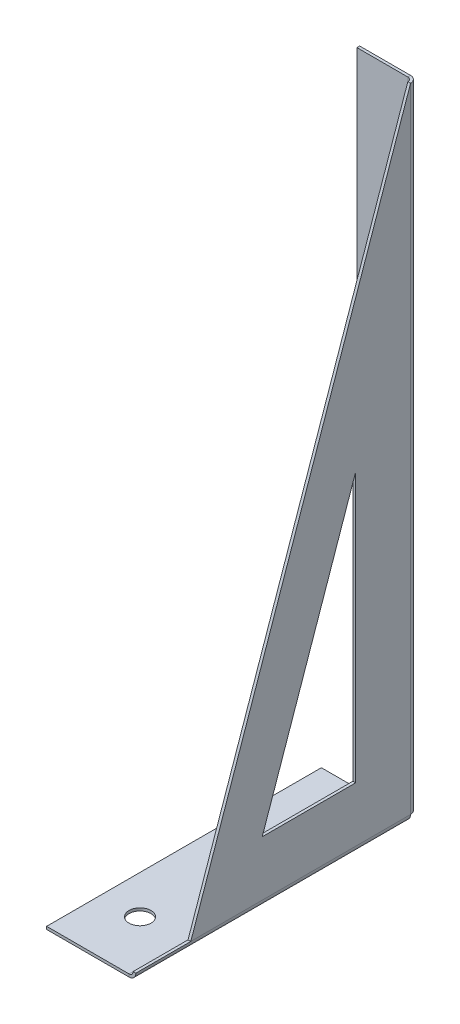
ISO-10303-21;
HEADER;
FILE_DESCRIPTION(('STEP AP214'),'2;1');
FILE_NAME('part.step','',(''),(''),'','','');
FILE_SCHEMA(('AUTOMOTIVE_DESIGN { 1 0 10303 214 1 1 1 1 }'));
ENDSEC;
DATA;
#1=APPLICATION_CONTEXT('core data for automotive mechanical design processes');
#2=APPLICATION_PROTOCOL_DEFINITION('international standard','automotive_design',2000,#1);
#3=PRODUCT_CONTEXT('',#1,'mechanical');
#4=PRODUCT('Part','Part','',(#3));
#5=PRODUCT_RELATED_PRODUCT_CATEGORY('part','',(#4));
#6=PRODUCT_DEFINITION_FORMATION('','',#4);
#7=PRODUCT_DEFINITION_CONTEXT('part definition',#1,'design');
#8=PRODUCT_DEFINITION('design','',#6,#7);
#9=PRODUCT_DEFINITION_SHAPE('','',#8);
#10=(LENGTH_UNIT() NAMED_UNIT(*) SI_UNIT(.MILLI.,.METRE.));
#11=(NAMED_UNIT(*) PLANE_ANGLE_UNIT() SI_UNIT($,.RADIAN.));
#12=(NAMED_UNIT(*) SI_UNIT($,.STERADIAN.) SOLID_ANGLE_UNIT());
#13=UNCERTAINTY_MEASURE_WITH_UNIT(LENGTH_MEASURE(1.E-05),#10,'distance_accuracy_value','');
#14=(GEOMETRIC_REPRESENTATION_CONTEXT(3) GLOBAL_UNCERTAINTY_ASSIGNED_CONTEXT((#13)) GLOBAL_UNIT_ASSIGNED_CONTEXT((#10,
#11,#12)) REPRESENTATION_CONTEXT('',''));
#15=CARTESIAN_POINT('',(0.,0.,0.));
#16=DIRECTION('',(0.,0.,1.));
#17=DIRECTION('',(1.,0.,0.));
#18=AXIS2_PLACEMENT_3D('',#15,#16,#17);
#19=CARTESIAN_POINT('',(1.2366,0.,0.));
#20=DIRECTION('',(-1.,0.,0.));
#21=DIRECTION('',(0.,-1.,0.));
#22=AXIS2_PLACEMENT_3D('',#19,#20,#21);
#23=PLANE('',#22);
#24=DIRECTION('',(0.,-1.,0.));
#25=VECTOR('',#24,1.);
#26=CARTESIAN_POINT('',(1.2366,0.,10.));
#27=LINE('',#26,#25);
#28=CARTESIAN_POINT('',(1.23660000000021,59.7366,10.));
#29=VERTEX_POINT('',#28);
#30=CARTESIAN_POINT('',(1.23660000000012,10.7366,10.));
#31=VERTEX_POINT('',#30);
#32=EDGE_CURVE('E264',#29,#31,#27,.T.);
#33=ORIENTED_EDGE('',*,*,#32,.T.);
#34=DIRECTION('',(0.,0.,1.));
#35=VECTOR('',#34,1.);
#36=CARTESIAN_POINT('',(1.23660000000004,10.7366,0.));
#37=LINE('',#36,#35);
#38=CARTESIAN_POINT('',(1.23660000000012,10.7366,27.));
#39=VERTEX_POINT('',#38);
#40=EDGE_CURVE('E267',#31,#39,#37,.T.);
#41=ORIENTED_EDGE('',*,*,#40,.T.);
#42=DIRECTION('',(0.,0.944756611917631,-0.327772702093872));
#43=VECTOR('',#42,1.);
#44=CARTESIAN_POINT('',(1.23660000000003,9.51445256505576,27.4240103345725));
#45=LINE('',#44,#43);
#46=EDGE_CURVE('E259',#39,#29,#45,.T.);
#47=ORIENTED_EDGE('',*,*,#46,.T.);
#48=EDGE_LOOP('',(#33,#41,#47));
#49=FACE_BOUND('',#48,.T.);
#50=DIRECTION('',(0.,-0.944729559802012,0.327850665450442));
#51=VECTOR('',#50,1.);
#52=CARTESIAN_POINT('',(1.23660000000005,12.4683828250105,35.9287049228079));
#53=LINE('',#52,#51);
#54=CARTESIAN_POINT('',(1.2366000000004,116.,0.));
#55=VERTEX_POINT('',#54);
#56=CARTESIAN_POINT('',(1.2366000000002,0.736599999999995,40.));
#57=VERTEX_POINT('',#56);
#58=EDGE_CURVE('E270',#55,#57,#53,.T.);
#59=ORIENTED_EDGE('',*,*,#58,.T.);
#60=DIRECTION('',(0.,0.,-1.));
#61=VECTOR('',#60,1.);
#62=CARTESIAN_POINT('',(1.23660000000001,0.736599999999996,50.));
#63=LINE('',#62,#61);
#64=CARTESIAN_POINT('',(1.23660000000001,0.736599999999992,0.));
#65=VERTEX_POINT('',#64);
#66=EDGE_CURVE('E291',#65,#57,#63,.F.);
#67=ORIENTED_EDGE('',*,*,#66,.F.);
#68=DIRECTION('',(0.,1.,0.));
#69=VECTOR('',#68,1.);
#70=CARTESIAN_POINT('',(1.2366,0.,0.));
#71=LINE('',#70,#69);
#72=EDGE_CURVE('E286',#65,#55,#71,.T.);
#73=ORIENTED_EDGE('',*,*,#72,.T.);
#74=EDGE_LOOP('',(#59,#67,#73));
#75=FACE_BOUND('',#74,.T.);
#76=ADVANCED_FACE('F75',(#49,#75),#23,.F.);
#77=CARTESIAN_POINT('',(0.736599999999997,0.,0.));
#78=DIRECTION('',(-1.,0.,0.));
#79=DIRECTION('',(0.,-1.,0.));
#80=AXIS2_PLACEMENT_3D('',#77,#78,#79);
#81=PLANE('',#80);
#82=DIRECTION('',(0.,0.,1.));
#83=VECTOR('',#82,1.);
#84=CARTESIAN_POINT('',(0.736600000000036,10.7366,10.));
#85=LINE('',#84,#83);
#86=CARTESIAN_POINT('',(0.736600000000036,10.7366,10.));
#87=VERTEX_POINT('',#86);
#88=CARTESIAN_POINT('',(0.736600000000038,10.7366,27.));
#89=VERTEX_POINT('',#88);
#90=EDGE_CURVE('E100',#87,#89,#85,.T.);
#91=ORIENTED_EDGE('',*,*,#90,.F.);
#92=DIRECTION('',(0.,-1.,0.));
#93=VECTOR('',#92,1.);
#94=CARTESIAN_POINT('',(0.736600000000036,10.7366,10.));
#95=LINE('',#94,#93);
#96=CARTESIAN_POINT('',(0.736600000000207,59.7366,10.));
#97=VERTEX_POINT('',#96);
#98=EDGE_CURVE('E253',#97,#87,#95,.T.);
#99=ORIENTED_EDGE('',*,*,#98,.F.);
#100=DIRECTION('',(0.,0.944756611917631,-0.327772702093872));
#101=VECTOR('',#100,1.);
#102=CARTESIAN_POINT('',(0.736600000000038,10.7366,27.));
#103=LINE('',#102,#101);
#104=EDGE_CURVE('E251',#89,#97,#103,.T.);
#105=ORIENTED_EDGE('',*,*,#104,.F.);
#106=EDGE_LOOP('',(#91,#99,#105));
#107=FACE_BOUND('',#106,.T.);
#108=DIRECTION('',(0.,0.,-1.));
#109=VECTOR('',#108,1.);
#110=CARTESIAN_POINT('',(0.736600000000006,0.736599999999997,50.));
#111=LINE('',#110,#109);
#112=CARTESIAN_POINT('',(0.736600000000005,0.736599999999996,40.));
#113=VERTEX_POINT('',#112);
#114=CARTESIAN_POINT('',(0.736600000000005,0.736599999999994,0.));
#115=VERTEX_POINT('',#114);
#116=EDGE_CURVE('E300',#113,#115,#111,.T.);
#117=ORIENTED_EDGE('',*,*,#116,.F.);
#118=DIRECTION('',(0.,-0.944729559802012,0.327850665450442));
#119=VECTOR('',#118,1.);
#120=CARTESIAN_POINT('',(0.736600000000045,12.4683828250105,35.9287049228079));
#121=LINE('',#120,#119);
#122=CARTESIAN_POINT('',(0.736600000000409,116.,0.));
#123=VERTEX_POINT('',#122);
#124=EDGE_CURVE('E271',#123,#113,#121,.T.);
#125=ORIENTED_EDGE('',*,*,#124,.F.);
#126=DIRECTION('',(0.,-1.,0.));
#127=VECTOR('',#126,1.);
#128=CARTESIAN_POINT('',(0.736600000000402,116.,0.));
#129=LINE('',#128,#127);
#130=EDGE_CURVE('E289',#115,#123,#129,.F.);
#131=ORIENTED_EDGE('',*,*,#130,.F.);
#132=EDGE_LOOP('',(#117,#125,#131));
#133=FACE_BOUND('',#132,.T.);
#134=ADVANCED_FACE('F365',(#107,#133),#81,.T.);
#135=CARTESIAN_POINT('',(-15.,-0.5,0.));
#136=DIRECTION('',(-1.,0.,0.));
#137=DIRECTION('',(0.,0.,1.));
#138=AXIS2_PLACEMENT_3D('',#135,#136,#137);
#139=PLANE('',#138);
#140=DIRECTION('',(0.,0.,1.));
#141=VECTOR('',#140,1.);
#142=CARTESIAN_POINT('',(-15.,0.,0.));
#143=LINE('',#142,#141);
#144=CARTESIAN_POINT('',(-15.,0.,0.));
#145=VERTEX_POINT('',#144);
#146=CARTESIAN_POINT('',(-15.,0.,50.));
#147=VERTEX_POINT('',#146);
#148=EDGE_CURVE('E305',#145,#147,#143,.T.);
#149=ORIENTED_EDGE('',*,*,#148,.F.);
#150=DIRECTION('',(0.,1.,0.));
#151=VECTOR('',#150,1.);
#152=CARTESIAN_POINT('',(-15.,-0.5,0.));
#153=LINE('',#152,#151);
#154=CARTESIAN_POINT('',(-15.,-0.5,0.));
#155=VERTEX_POINT('',#154);
#156=EDGE_CURVE('E13',#155,#145,#153,.T.);
#157=ORIENTED_EDGE('',*,*,#156,.F.);
#158=DIRECTION('',(0.,0.,1.));
#159=VECTOR('',#158,1.);
#160=CARTESIAN_POINT('',(-15.,-0.5,0.));
#161=LINE('',#160,#159);
#162=CARTESIAN_POINT('',(-15.,-0.5,50.));
#163=VERTEX_POINT('',#162);
#164=EDGE_CURVE('E314',#155,#163,#161,.T.);
#165=ORIENTED_EDGE('',*,*,#164,.T.);
#166=DIRECTION('',(0.,1.,0.));
#167=VECTOR('',#166,1.);
#168=CARTESIAN_POINT('',(-15.,-0.5,50.));
#169=LINE('',#168,#167);
#170=EDGE_CURVE('E79',#163,#147,#169,.T.);
#171=ORIENTED_EDGE('',*,*,#170,.T.);
#172=EDGE_LOOP('',(#149,#157,#165,#171));
#173=FACE_BOUND('',#172,.T.);
#174=ADVANCED_FACE('F77',(#173),#139,.T.);
#175=CARTESIAN_POINT('',(-15.,-0.5,0.));
#176=DIRECTION('',(0.,0.,-1.));
#177=DIRECTION('',(-1.,0.,0.));
#178=AXIS2_PLACEMENT_3D('',#175,#176,#177);
#179=PLANE('',#178);
#180=DIRECTION('',(-1.,0.,0.));
#181=VECTOR('',#180,1.);
#182=CARTESIAN_POINT('',(-15.,0.,0.));
#183=LINE('',#182,#181);
#184=CARTESIAN_POINT('',(0.,0.,0.));
#185=VERTEX_POINT('',#184);
#186=EDGE_CURVE('E318',#185,#145,#183,.T.);
#187=ORIENTED_EDGE('',*,*,#186,.F.);
#188=DIRECTION('',(0.,1.,0.));
#189=VECTOR('',#188,1.);
#190=CARTESIAN_POINT('',(0.,-0.5,0.));
#191=LINE('',#190,#189);
#192=CARTESIAN_POINT('',(0.,-0.499999999999997,0.));
#193=VERTEX_POINT('',#192);
#194=EDGE_CURVE('E84',#193,#185,#191,.T.);
#195=ORIENTED_EDGE('',*,*,#194,.F.);
#196=DIRECTION('',(-1.,0.,0.));
#197=VECTOR('',#196,1.);
#198=CARTESIAN_POINT('',(-15.,-0.5,0.));
#199=LINE('',#198,#197);
#200=EDGE_CURVE('E324',#193,#155,#199,.T.);
#201=ORIENTED_EDGE('',*,*,#200,.T.);
#202=ORIENTED_EDGE('',*,*,#156,.T.);
#203=EDGE_LOOP('',(#187,#195,#201,#202));
#204=FACE_BOUND('',#203,.T.);
#205=ADVANCED_FACE('F352',(#204),#179,.T.);
#206=CARTESIAN_POINT('',(-15.,-0.5,50.));
#207=DIRECTION('',(0.,0.,1.));
#208=DIRECTION('',(1.,0.,0.));
#209=AXIS2_PLACEMENT_3D('',#206,#207,#208);
#210=PLANE('',#209);
#211=DIRECTION('',(1.,0.,0.));
#212=VECTOR('',#211,1.);
#213=CARTESIAN_POINT('',(-15.,0.,50.));
#214=LINE('',#213,#212);
#215=CARTESIAN_POINT('',(0.,0.,50.));
#216=VERTEX_POINT('',#215);
#217=EDGE_CURVE('E329',#147,#216,#214,.T.);
#218=ORIENTED_EDGE('',*,*,#217,.F.);
#219=ORIENTED_EDGE('',*,*,#170,.F.);
#220=DIRECTION('',(1.,0.,0.));
#221=VECTOR('',#220,1.);
#222=CARTESIAN_POINT('',(-15.,-0.5,50.));
#223=LINE('',#222,#221);
#224=CARTESIAN_POINT('',(0.,-0.5,50.));
#225=VERTEX_POINT('',#224);
#226=EDGE_CURVE('E317',#163,#225,#223,.T.);
#227=ORIENTED_EDGE('',*,*,#226,.T.);
#228=DIRECTION('',(0.,1.,0.));
#229=VECTOR('',#228,1.);
#230=CARTESIAN_POINT('',(0.,-0.5,50.));
#231=LINE('',#230,#229);
#232=EDGE_CURVE('E337',#225,#216,#231,.T.);
#233=ORIENTED_EDGE('',*,*,#232,.T.);
#234=EDGE_LOOP('',(#218,#219,#227,#233));
#235=FACE_BOUND('',#234,.T.);
#236=ADVANCED_FACE('F345',(#235),#210,.T.);
#237=CARTESIAN_POINT('',(0.,-0.5,0.));
#238=DIRECTION('',(0.,1.,0.));
#239=DIRECTION('',(0.,0.,1.));
#240=AXIS2_PLACEMENT_3D('',#237,#238,#239);
#241=PLANE('',#240);
#242=CARTESIAN_POINT('',(-8.,-0.5,7.));
#243=DIRECTION('',(0.,1.,0.));
#244=DIRECTION('',(0.,0.,1.));
#245=AXIS2_PLACEMENT_3D('',#242,#243,#244);
#246=CIRCLE('',#245,2.);
#247=CARTESIAN_POINT('',(-8.,-0.5,9.));
#248=VERTEX_POINT('',#247);
#249=EDGE_CURVE('E241',#248,#248,#246,.T.);
#250=ORIENTED_EDGE('',*,*,#249,.T.);
#251=EDGE_LOOP('',(#250));
#252=FACE_BOUND('',#251,.T.);
#253=CARTESIAN_POINT('',(-8.,-0.5,40.));
#254=DIRECTION('',(0.,1.,0.));
#255=DIRECTION('',(0.,0.,1.));
#256=AXIS2_PLACEMENT_3D('',#253,#254,#255);
#257=CIRCLE('',#256,2.);
#258=CARTESIAN_POINT('',(-8.,-0.5,42.));
#259=VERTEX_POINT('',#258);
#260=EDGE_CURVE('E247',#259,#259,#257,.T.);
#261=ORIENTED_EDGE('',*,*,#260,.T.);
#262=EDGE_LOOP('',(#261));
#263=FACE_BOUND('',#262,.T.);
#264=ORIENTED_EDGE('',*,*,#164,.F.);
#265=ORIENTED_EDGE('',*,*,#200,.F.);
#266=DIRECTION('',(0.,0.,-1.));
#267=VECTOR('',#266,1.);
#268=CARTESIAN_POINT('',(0.,-0.5,0.));
#269=LINE('',#268,#267);
#270=EDGE_CURVE('E321',#225,#193,#269,.T.);
#271=ORIENTED_EDGE('',*,*,#270,.F.);
#272=ORIENTED_EDGE('',*,*,#226,.F.);
#273=EDGE_LOOP('',(#264,#265,#271,#272));
#274=FACE_BOUND('',#273,.T.);
#275=ADVANCED_FACE('F389',(#252,#263,#274),#241,.F.);
#276=CARTESIAN_POINT('',(0.,0.,0.));
#277=DIRECTION('',(0.,1.,0.));
#278=DIRECTION('',(0.,0.,1.));
#279=AXIS2_PLACEMENT_3D('',#276,#277,#278);
#280=PLANE('',#279);
#281=CARTESIAN_POINT('',(-8.,0.,7.));
#282=DIRECTION('',(0.,1.,0.));
#283=DIRECTION('',(0.,0.,1.));
#284=AXIS2_PLACEMENT_3D('',#281,#282,#283);
#285=CIRCLE('',#284,2.);
#286=CARTESIAN_POINT('',(-8.,0.,9.));
#287=VERTEX_POINT('',#286);
#288=EDGE_CURVE('E229',#287,#287,#285,.T.);
#289=ORIENTED_EDGE('',*,*,#288,.F.);
#290=EDGE_LOOP('',(#289));
#291=FACE_BOUND('',#290,.T.);
#292=CARTESIAN_POINT('',(-8.,0.,40.));
#293=DIRECTION('',(0.,1.,0.));
#294=DIRECTION('',(0.,0.,1.));
#295=AXIS2_PLACEMENT_3D('',#292,#293,#294);
#296=CIRCLE('',#295,2.);
#297=CARTESIAN_POINT('',(-8.,0.,42.));
#298=VERTEX_POINT('',#297);
#299=EDGE_CURVE('E244',#298,#298,#296,.T.);
#300=ORIENTED_EDGE('',*,*,#299,.F.);
#301=EDGE_LOOP('',(#300));
#302=FACE_BOUND('',#301,.T.);
#303=ORIENTED_EDGE('',*,*,#148,.T.);
#304=ORIENTED_EDGE('',*,*,#217,.T.);
#305=DIRECTION('',(0.,0.,-1.));
#306=VECTOR('',#305,1.);
#307=CARTESIAN_POINT('',(0.,0.,0.));
#308=LINE('',#307,#306);
#309=EDGE_CURVE('E332',#216,#185,#308,.T.);
#310=ORIENTED_EDGE('',*,*,#309,.T.);
#311=ORIENTED_EDGE('',*,*,#186,.T.);
#312=EDGE_LOOP('',(#303,#304,#310,#311));
#313=FACE_BOUND('',#312,.T.);
#314=ADVANCED_FACE('F348',(#291,#302,#313),#280,.T.);
#315=CARTESIAN_POINT('',(0.,0.736599999999999,50.));
#316=DIRECTION('',(0.,0.,1.));
#317=DIRECTION('',(1.,0.,0.));
#318=AXIS2_PLACEMENT_3D('',#315,#316,#317);
#319=PLANE('',#318);
#320=DIRECTION('',(-1.,0.,0.));
#321=VECTOR('',#320,1.);
#322=CARTESIAN_POINT('',(1.23660000000001,0.736599999999996,50.));
#323=LINE('',#322,#321);
#324=CARTESIAN_POINT('',(0.736600000000006,0.736599999999996,50.));
#325=VERTEX_POINT('',#324);
#326=CARTESIAN_POINT('',(1.2366,0.736599999999995,50.));
#327=VERTEX_POINT('',#326);
#328=EDGE_CURVE('E281',#325,#327,#323,.F.);
#329=ORIENTED_EDGE('',*,*,#328,.F.);
#330=CARTESIAN_POINT('',(0.,0.736599999999999,50.));
#331=DIRECTION('',(0.,0.,-1.));
#332=DIRECTION('',(-1.,0.,0.));
#333=AXIS2_PLACEMENT_3D('',#330,#331,#332);
#334=CIRCLE('',#333,0.736599999999999);
#335=EDGE_CURVE('E309',#216,#325,#334,.F.);
#336=ORIENTED_EDGE('',*,*,#335,.F.);
#337=ORIENTED_EDGE('',*,*,#232,.F.);
#338=CARTESIAN_POINT('',(0.,0.736599999999999,50.));
#339=DIRECTION('',(0.,0.,-1.));
#340=DIRECTION('',(-1.,0.,0.));
#341=AXIS2_PLACEMENT_3D('',#338,#339,#340);
#342=CIRCLE('',#341,1.2366);
#343=EDGE_CURVE('E302',#225,#327,#342,.F.);
#344=ORIENTED_EDGE('',*,*,#343,.T.);
#345=EDGE_LOOP('',(#329,#336,#337,#344));
#346=FACE_BOUND('',#345,.T.);
#347=ADVANCED_FACE('F392',(#346),#319,.T.);
#348=CARTESIAN_POINT('',(0.,0.736600000000003,0.));
#349=DIRECTION('',(0.,0.,1.));
#350=DIRECTION('',(1.,0.,0.));
#351=AXIS2_PLACEMENT_3D('',#348,#349,#350);
#352=PLANE('',#351);
#353=CARTESIAN_POINT('',(0.,0.736600000000003,0.));
#354=DIRECTION('',(0.,0.,-1.));
#355=DIRECTION('',(-1.,0.,0.));
#356=AXIS2_PLACEMENT_3D('',#353,#354,#355);
#357=CIRCLE('',#356,0.736599999999999);
#358=EDGE_CURVE('E285',#115,#185,#357,.T.);
#359=ORIENTED_EDGE('',*,*,#358,.F.);
#360=DIRECTION('',(-1.,0.,0.));
#361=VECTOR('',#360,1.);
#362=CARTESIAN_POINT('',(0.7366,0.736599999999999,0.));
#363=LINE('',#362,#361);
#364=EDGE_CURVE('E294',#115,#65,#363,.F.);
#365=ORIENTED_EDGE('',*,*,#364,.T.);
#366=CARTESIAN_POINT('',(0.,0.736600000000003,0.));
#367=DIRECTION('',(0.,0.,-1.));
#368=DIRECTION('',(-1.,0.,0.));
#369=AXIS2_PLACEMENT_3D('',#366,#367,#368);
#370=CIRCLE('',#369,1.2366);
#371=EDGE_CURVE('E306',#65,#193,#370,.T.);
#372=ORIENTED_EDGE('',*,*,#371,.T.);
#373=ORIENTED_EDGE('',*,*,#194,.T.);
#374=EDGE_LOOP('',(#359,#365,#372,#373));
#375=FACE_BOUND('',#374,.T.);
#376=ADVANCED_FACE('F355',(#375),#352,.F.);
#377=CARTESIAN_POINT('',(0.,0.736600000000003,0.));
#378=DIRECTION('',(0.,0.,-1.));
#379=DIRECTION('',(1.,0.,0.));
#380=AXIS2_PLACEMENT_3D('',#377,#378,#379);
#381=CYLINDRICAL_SURFACE('',#380,1.2366);
#382=ORIENTED_EDGE('',*,*,#270,.T.);
#383=ORIENTED_EDGE('',*,*,#371,.F.);
#384=ORIENTED_EDGE('',*,*,#66,.T.);
#385=DIRECTION('',(0.,0.,1.));
#386=VECTOR('',#385,1.);
#387=CARTESIAN_POINT('',(1.2366,0.736599999999995,0.));
#388=LINE('',#387,#386);
#389=EDGE_CURVE('E274',#57,#327,#388,.T.);
#390=ORIENTED_EDGE('',*,*,#389,.T.);
#391=ORIENTED_EDGE('',*,*,#343,.F.);
#392=EDGE_LOOP('',(#382,#383,#384,#390,#391));
#393=FACE_BOUND('',#392,.T.);
#394=ADVANCED_FACE('F386',(#393),#381,.T.);
#395=CARTESIAN_POINT('',(0.,0.736600000000003,0.));
#396=DIRECTION('',(0.,0.,-1.));
#397=DIRECTION('',(1.,0.,0.));
#398=AXIS2_PLACEMENT_3D('',#395,#396,#397);
#399=CYLINDRICAL_SURFACE('',#398,0.736599999999999);
#400=ORIENTED_EDGE('',*,*,#309,.F.);
#401=ORIENTED_EDGE('',*,*,#335,.T.);
#402=EDGE_CURVE('E297',#325,#113,#111,.T.);
#403=ORIENTED_EDGE('',*,*,#402,.T.);
#404=ORIENTED_EDGE('',*,*,#116,.T.);
#405=ORIENTED_EDGE('',*,*,#358,.T.);
#406=EDGE_LOOP('',(#400,#401,#403,#404,#405));
#407=FACE_BOUND('',#406,.T.);
#408=ADVANCED_FACE('F360',(#407),#399,.F.);
#409=CARTESIAN_POINT('',(1.2366,0.736599999999995,0.));
#410=DIRECTION('',(0.,-1.,0.));
#411=DIRECTION('',(0.,0.,1.));
#412=AXIS2_PLACEMENT_3D('',#409,#410,#411);
#413=PLANE('',#412);
#414=ORIENTED_EDGE('',*,*,#328,.T.);
#415=ORIENTED_EDGE('',*,*,#389,.F.);
#416=DIRECTION('',(1.,0.,0.));
#417=VECTOR('',#416,1.);
#418=CARTESIAN_POINT('',(1.2366000000002,0.736599999999995,40.));
#419=LINE('',#418,#417);
#420=EDGE_CURVE('E273',#57,#113,#419,.F.);
#421=ORIENTED_EDGE('',*,*,#420,.T.);
#422=ORIENTED_EDGE('',*,*,#402,.F.);
#423=EDGE_LOOP('',(#414,#415,#421,#422));
#424=FACE_BOUND('',#423,.T.);
#425=ADVANCED_FACE('F394',(#424),#413,.F.);
#426=CARTESIAN_POINT('',(1.23660000000005,12.4683828250105,35.9287049228079));
#427=DIRECTION('',(0.,-0.327850665450442,-0.944729559802012));
#428=DIRECTION('',(0.,-0.944729559802012,0.327850665450442));
#429=AXIS2_PLACEMENT_3D('',#426,#427,#428);
#430=PLANE('',#429);
#431=ORIENTED_EDGE('',*,*,#420,.F.);
#432=ORIENTED_EDGE('',*,*,#58,.F.);
#433=DIRECTION('',(-1.,0.,0.));
#434=VECTOR('',#433,1.);
#435=CARTESIAN_POINT('',(1.2366000000004,116.,0.));
#436=LINE('',#435,#434);
#437=EDGE_CURVE('E282',#55,#123,#436,.T.);
#438=ORIENTED_EDGE('',*,*,#437,.T.);
#439=ORIENTED_EDGE('',*,*,#124,.T.);
#440=EDGE_LOOP('',(#431,#432,#438,#439));
#441=FACE_BOUND('',#440,.T.);
#442=ADVANCED_FACE('F377',(#441),#430,.F.);
#443=CARTESIAN_POINT('',(10.7366,10.7366,10.));
#444=DIRECTION('',(0.,-1.,0.));
#445=DIRECTION('',(1.,0.,0.));
#446=AXIS2_PLACEMENT_3D('',#443,#444,#445);
#447=PLANE('',#446);
#448=DIRECTION('',(-1.,0.,0.));
#449=VECTOR('',#448,1.);
#450=CARTESIAN_POINT('',(10.7366,10.7366,10.));
#451=LINE('',#450,#449);
#452=EDGE_CURVE('E257',#31,#87,#451,.T.);
#453=ORIENTED_EDGE('',*,*,#452,.T.);
#454=ORIENTED_EDGE('',*,*,#90,.T.);
#455=DIRECTION('',(-1.,0.,0.));
#456=VECTOR('',#455,1.);
#457=CARTESIAN_POINT('',(10.7366,10.7366,27.));
#458=LINE('',#457,#456);
#459=EDGE_CURVE('E256',#39,#89,#458,.T.);
#460=ORIENTED_EDGE('',*,*,#459,.F.);
#461=ORIENTED_EDGE('',*,*,#40,.F.);
#462=EDGE_LOOP('',(#453,#454,#460,#461));
#463=FACE_BOUND('',#462,.T.);
#464=ADVANCED_FACE('F401',(#463),#447,.F.);
#465=CARTESIAN_POINT('',(10.7366,10.7366,10.));
#466=DIRECTION('',(0.,0.,-1.));
#467=DIRECTION('',(-1.,0.,0.));
#468=AXIS2_PLACEMENT_3D('',#465,#466,#467);
#469=PLANE('',#468);
#470=DIRECTION('',(-1.,0.,0.));
#471=VECTOR('',#470,1.);
#472=CARTESIAN_POINT('',(10.7366000000002,59.7366,10.));
#473=LINE('',#472,#471);
#474=EDGE_CURVE('E92',#29,#97,#473,.T.);
#475=ORIENTED_EDGE('',*,*,#474,.T.);
#476=ORIENTED_EDGE('',*,*,#98,.T.);
#477=ORIENTED_EDGE('',*,*,#452,.F.);
#478=ORIENTED_EDGE('',*,*,#32,.F.);
#479=EDGE_LOOP('',(#475,#476,#477,#478));
#480=FACE_BOUND('',#479,.T.);
#481=ADVANCED_FACE('F594',(#480),#469,.F.);
#482=CARTESIAN_POINT('',(10.7366,10.7366,27.));
#483=DIRECTION('',(0.,0.327772702093872,0.944756611917631));
#484=DIRECTION('',(0.,-0.944756611917631,0.327772702093872));
#485=AXIS2_PLACEMENT_3D('',#482,#483,#484);
#486=PLANE('',#485);
#487=ORIENTED_EDGE('',*,*,#459,.T.);
#488=ORIENTED_EDGE('',*,*,#104,.T.);
#489=ORIENTED_EDGE('',*,*,#474,.F.);
#490=ORIENTED_EDGE('',*,*,#46,.F.);
#491=EDGE_LOOP('',(#487,#488,#489,#490));
#492=FACE_BOUND('',#491,.T.);
#493=ADVANCED_FACE('F585',(#492),#486,.F.);
#494=CARTESIAN_POINT('',(-8.,-10.,40.));
#495=DIRECTION('',(0.,1.,0.));
#496=DIRECTION('',(0.,0.,1.));
#497=AXIS2_PLACEMENT_3D('',#494,#495,#496);
#498=CYLINDRICAL_SURFACE('',#497,2.);
#499=ORIENTED_EDGE('',*,*,#299,.T.);
#500=EDGE_LOOP('',(#499));
#501=FACE_BOUND('',#500,.T.);
#502=ORIENTED_EDGE('',*,*,#260,.F.);
#503=EDGE_LOOP('',(#502));
#504=FACE_BOUND('',#503,.T.);
#505=ADVANCED_FACE('F575',(#501,#504),#498,.F.);
#506=CARTESIAN_POINT('',(-8.,-10.,7.));
#507=DIRECTION('',(0.,1.,0.));
#508=DIRECTION('',(0.,0.,1.));
#509=AXIS2_PLACEMENT_3D('',#506,#507,#508);
#510=CYLINDRICAL_SURFACE('',#509,2.);
#511=ORIENTED_EDGE('',*,*,#288,.T.);
#512=EDGE_LOOP('',(#511));
#513=FACE_BOUND('',#512,.T.);
#514=ORIENTED_EDGE('',*,*,#249,.F.);
#515=EDGE_LOOP('',(#514));
#516=FACE_BOUND('',#515,.T.);
#517=ADVANCED_FACE('F480',(#513,#516),#510,.F.);
#518=CARTESIAN_POINT('',(4.04971654476254E-13,116.,0.));
#519=DIRECTION('',(0.,1.,0.));
#520=DIRECTION('',(-1.,0.,0.));
#521=AXIS2_PLACEMENT_3D('',#518,#519,#520);
#522=PLANE('',#521);
#523=DIRECTION('',(0.,0.,1.));
#524=VECTOR('',#523,1.);
#525=CARTESIAN_POINT('',(4.04949511423336E-13,116.,-1.2366));
#526=LINE('',#525,#524);
#527=CARTESIAN_POINT('',(4.07457202466114E-13,116.,-0.7366));
#528=VERTEX_POINT('',#527);
#529=CARTESIAN_POINT('',(4.09144378674273E-13,116.,-1.2366));
#530=VERTEX_POINT('',#529);
#531=EDGE_CURVE('E208',#528,#530,#526,.F.);
#532=ORIENTED_EDGE('',*,*,#531,.F.);
#533=CARTESIAN_POINT('',(4.04971654476254E-13,116.,0.));
#534=DIRECTION('',(0.,-1.,0.));
#535=DIRECTION('',(1.,0.,0.));
#536=AXIS2_PLACEMENT_3D('',#533,#534,#535);
#537=CIRCLE('',#536,0.736600000000004);
#538=EDGE_CURVE('E233',#123,#528,#537,.F.);
#539=ORIENTED_EDGE('',*,*,#538,.F.);
#540=ORIENTED_EDGE('',*,*,#437,.F.);
#541=CARTESIAN_POINT('',(4.04971654476254E-13,116.,0.));
#542=DIRECTION('',(0.,-1.,0.));
#543=DIRECTION('',(1.,0.,0.));
#544=AXIS2_PLACEMENT_3D('',#541,#542,#543);
#545=CIRCLE('',#544,1.2366);
#546=EDGE_CURVE('E226',#55,#530,#545,.F.);
#547=ORIENTED_EDGE('',*,*,#546,.T.);
#548=EDGE_LOOP('',(#532,#539,#540,#547));
#549=FACE_BOUND('',#548,.T.);
#550=ADVANCED_FACE('F373',(#549),#522,.T.);
#551=CARTESIAN_POINT('',(0.,0.736599999999997,0.));
#552=DIRECTION('',(0.,1.,0.));
#553=DIRECTION('',(-1.,0.,0.));
#554=AXIS2_PLACEMENT_3D('',#551,#552,#553);
#555=PLANE('',#554);
#556=CARTESIAN_POINT('',(0.,0.736599999999997,0.));
#557=DIRECTION('',(0.,-1.,0.));
#558=DIRECTION('',(1.,0.,0.));
#559=AXIS2_PLACEMENT_3D('',#556,#557,#558);
#560=CIRCLE('',#559,0.736600000000004);
#561=CARTESIAN_POINT('',(0.,0.736599999999997,-0.736600000000008));
#562=VERTEX_POINT('',#561);
#563=EDGE_CURVE('E236',#562,#115,#560,.T.);
#564=ORIENTED_EDGE('',*,*,#563,.F.);
#565=DIRECTION('',(0.,0.,1.));
#566=VECTOR('',#565,1.);
#567=CARTESIAN_POINT('',(0.,0.73659999999999,-0.7366));
#568=LINE('',#567,#566);
#569=CARTESIAN_POINT('',(0.,0.736599999999997,-1.2366));
#570=VERTEX_POINT('',#569);
#571=EDGE_CURVE('E220',#562,#570,#568,.F.);
#572=ORIENTED_EDGE('',*,*,#571,.T.);
#573=CARTESIAN_POINT('',(0.,0.736599999999997,0.));
#574=DIRECTION('',(0.,-1.,0.));
#575=DIRECTION('',(1.,0.,0.));
#576=AXIS2_PLACEMENT_3D('',#573,#574,#575);
#577=CIRCLE('',#576,1.2366);
#578=EDGE_CURVE('E230',#570,#65,#577,.T.);
#579=ORIENTED_EDGE('',*,*,#578,.T.);
#580=ORIENTED_EDGE('',*,*,#364,.F.);
#581=EDGE_LOOP('',(#564,#572,#579,#580));
#582=FACE_BOUND('',#581,.T.);
#583=ADVANCED_FACE('F383',(#582),#555,.F.);
#584=CARTESIAN_POINT('',(0.,0.736600000000011,0.));
#585=DIRECTION('',(0.,-1.,0.));
#586=DIRECTION('',(0.,0.,-1.));
#587=AXIS2_PLACEMENT_3D('',#584,#585,#586);
#588=CYLINDRICAL_SURFACE('',#587,1.2366);
#589=ORIENTED_EDGE('',*,*,#72,.F.);
#590=ORIENTED_EDGE('',*,*,#578,.F.);
#591=DIRECTION('',(0.,-1.,0.));
#592=VECTOR('',#591,1.);
#593=CARTESIAN_POINT('',(4.04971654476253E-13,116.,-1.2366));
#594=LINE('',#593,#592);
#595=EDGE_CURVE('E218',#570,#530,#594,.F.);
#596=ORIENTED_EDGE('',*,*,#595,.T.);
#597=ORIENTED_EDGE('',*,*,#546,.F.);
#598=EDGE_LOOP('',(#589,#590,#596,#597));
#599=FACE_BOUND('',#598,.T.);
#600=ADVANCED_FACE('F381',(#599),#588,.T.);
#601=CARTESIAN_POINT('',(0.,0.736600000000011,0.));
#602=DIRECTION('',(0.,-1.,0.));
#603=DIRECTION('',(0.,0.,-1.));
#604=AXIS2_PLACEMENT_3D('',#601,#602,#603);
#605=CYLINDRICAL_SURFACE('',#604,0.736600000000004);
#606=ORIENTED_EDGE('',*,*,#130,.T.);
#607=ORIENTED_EDGE('',*,*,#538,.T.);
#608=DIRECTION('',(0.,-1.,0.));
#609=VECTOR('',#608,1.);
#610=CARTESIAN_POINT('',(4.04971654476253E-13,116.,-0.7366));
#611=LINE('',#610,#609);
#612=EDGE_CURVE('E223',#528,#562,#611,.T.);
#613=ORIENTED_EDGE('',*,*,#612,.T.);
#614=ORIENTED_EDGE('',*,*,#563,.T.);
#615=EDGE_LOOP('',(#606,#607,#613,#614));
#616=FACE_BOUND('',#615,.T.);
#617=ADVANCED_FACE('F368',(#616),#605,.F.);
#618=CARTESIAN_POINT('',(-9.2634,0.736600000000038,-1.23660000000003));
#619=DIRECTION('',(0.,1.,0.));
#620=DIRECTION('',(-1.,0.,0.));
#621=AXIS2_PLACEMENT_3D('',#618,#619,#620);
#622=PLANE('',#621);
#623=ORIENTED_EDGE('',*,*,#571,.F.);
#624=DIRECTION('',(1.,0.,0.));
#625=VECTOR('',#624,1.);
#626=CARTESIAN_POINT('',(-9.2634,0.736600000000038,-0.736600000000031));
#627=LINE('',#626,#625);
#628=CARTESIAN_POINT('',(-9.2634,0.736600000000033,-0.736600000000031));
#629=VERTEX_POINT('',#628);
#630=EDGE_CURVE('E216',#562,#629,#627,.F.);
#631=ORIENTED_EDGE('',*,*,#630,.T.);
#632=DIRECTION('',(0.,0.,1.));
#633=VECTOR('',#632,1.);
#634=CARTESIAN_POINT('',(-9.2634,0.736600000000032,-1.23660000000003));
#635=LINE('',#634,#633);
#636=CARTESIAN_POINT('',(-9.2634,0.736600000000035,-1.23660000000003));
#637=VERTEX_POINT('',#636);
#638=EDGE_CURVE('E204',#637,#629,#635,.T.);
#639=ORIENTED_EDGE('',*,*,#638,.F.);
#640=DIRECTION('',(-1.,0.,0.));
#641=VECTOR('',#640,1.);
#642=CARTESIAN_POINT('',(0.,0.736600000000003,-1.2366));
#643=LINE('',#642,#641);
#644=EDGE_CURVE('E191',#570,#637,#643,.T.);
#645=ORIENTED_EDGE('',*,*,#644,.F.);
#646=EDGE_LOOP('',(#623,#631,#639,#645));
#647=FACE_BOUND('',#646,.T.);
#648=ADVANCED_FACE('F510',(#647),#622,.F.);
#649=CARTESIAN_POINT('',(0.736600000000404,116.,-1.2366));
#650=DIRECTION('',(0.,-1.,0.));
#651=DIRECTION('',(1.,0.,0.));
#652=AXIS2_PLACEMENT_3D('',#649,#650,#651);
#653=PLANE('',#652);
#654=ORIENTED_EDGE('',*,*,#531,.T.);
#655=DIRECTION('',(1.,0.,0.));
#656=VECTOR('',#655,1.);
#657=CARTESIAN_POINT('',(4.84547914755771E-13,116.,-1.2366));
#658=LINE('',#657,#656);
#659=CARTESIAN_POINT('',(-9.2633999999996,116.,-1.23660000000003));
#660=VERTEX_POINT('',#659);
#661=EDGE_CURVE('E189',#660,#530,#658,.T.);
#662=ORIENTED_EDGE('',*,*,#661,.F.);
#663=DIRECTION('',(0.,0.,1.));
#664=VECTOR('',#663,1.);
#665=CARTESIAN_POINT('',(-9.2633999999996,116.,-1.23660000000003));
#666=LINE('',#665,#664);
#667=CARTESIAN_POINT('',(-9.2633999999996,116.,-0.736600000000031));
#668=VERTEX_POINT('',#667);
#669=EDGE_CURVE('E197',#660,#668,#666,.T.);
#670=ORIENTED_EDGE('',*,*,#669,.T.);
#671=DIRECTION('',(-1.,0.,0.));
#672=VECTOR('',#671,1.);
#673=CARTESIAN_POINT('',(0.736600000000402,116.,-0.736599999999997));
#674=LINE('',#673,#672);
#675=EDGE_CURVE('E213',#668,#528,#674,.F.);
#676=ORIENTED_EDGE('',*,*,#675,.T.);
#677=EDGE_LOOP('',(#654,#662,#670,#676));
#678=FACE_BOUND('',#677,.T.);
#679=ADVANCED_FACE('F207',(#678),#653,.F.);
#680=CARTESIAN_POINT('',(0.,0.,-1.2366));
#681=DIRECTION('',(0.,0.,1.));
#682=DIRECTION('',(1.,0.,0.));
#683=AXIS2_PLACEMENT_3D('',#680,#681,#682);
#684=PLANE('',#683);
#685=ORIENTED_EDGE('',*,*,#595,.F.);
#686=ORIENTED_EDGE('',*,*,#644,.T.);
#687=DIRECTION('',(0.,1.,0.));
#688=VECTOR('',#687,1.);
#689=CARTESIAN_POINT('',(-9.2634,0.,-1.23660000000003));
#690=LINE('',#689,#688);
#691=EDGE_CURVE('E184',#637,#660,#690,.T.);
#692=ORIENTED_EDGE('',*,*,#691,.T.);
#693=ORIENTED_EDGE('',*,*,#661,.T.);
#694=EDGE_LOOP('',(#685,#686,#692,#693));
#695=FACE_BOUND('',#694,.T.);
#696=ADVANCED_FACE('F187',(#695),#684,.F.);
#697=CARTESIAN_POINT('',(0.,0.,-0.7366));
#698=DIRECTION('',(0.,0.,1.));
#699=DIRECTION('',(1.,0.,0.));
#700=AXIS2_PLACEMENT_3D('',#697,#698,#699);
#701=PLANE('',#700);
#702=ORIENTED_EDGE('',*,*,#630,.F.);
#703=ORIENTED_EDGE('',*,*,#612,.F.);
#704=ORIENTED_EDGE('',*,*,#675,.F.);
#705=DIRECTION('',(0.,-1.,0.));
#706=VECTOR('',#705,1.);
#707=CARTESIAN_POINT('',(-9.2633999999996,116.,-0.736600000000031));
#708=LINE('',#707,#706);
#709=EDGE_CURVE('E200',#629,#668,#708,.F.);
#710=ORIENTED_EDGE('',*,*,#709,.F.);
#711=EDGE_LOOP('',(#702,#703,#704,#710));
#712=FACE_BOUND('',#711,.T.);
#713=ADVANCED_FACE('F539',(#712),#701,.T.);
#714=CARTESIAN_POINT('',(-9.2633999999996,116.,-1.23660000000003));
#715=DIRECTION('',(1.,0.,0.));
#716=DIRECTION('',(0.,1.,0.));
#717=AXIS2_PLACEMENT_3D('',#714,#715,#716);
#718=PLANE('',#717);
#719=ORIENTED_EDGE('',*,*,#709,.T.);
#720=ORIENTED_EDGE('',*,*,#669,.F.);
#721=ORIENTED_EDGE('',*,*,#691,.F.);
#722=ORIENTED_EDGE('',*,*,#638,.T.);
#723=EDGE_LOOP('',(#719,#720,#721,#722));
#724=FACE_BOUND('',#723,.T.);
#725=ADVANCED_FACE('F198',(#724),#718,.F.);
#726=CLOSED_SHELL('',(#76,#134,#174,#205,#236,#275,#314,#347,#376,#394,#408,#425,#442,#464,#481,
#493,#505,#517,#550,#583,#600,#617,#648,#679,#696,#713,#725));
#727=MANIFOLD_SOLID_BREP('B2',#726);
#728=ADVANCED_BREP_SHAPE_REPRESENTATION('',(#18,#727),#14);
#729=SHAPE_DEFINITION_REPRESENTATION(#9,#728);
ENDSEC;
END-ISO-10303-21;
